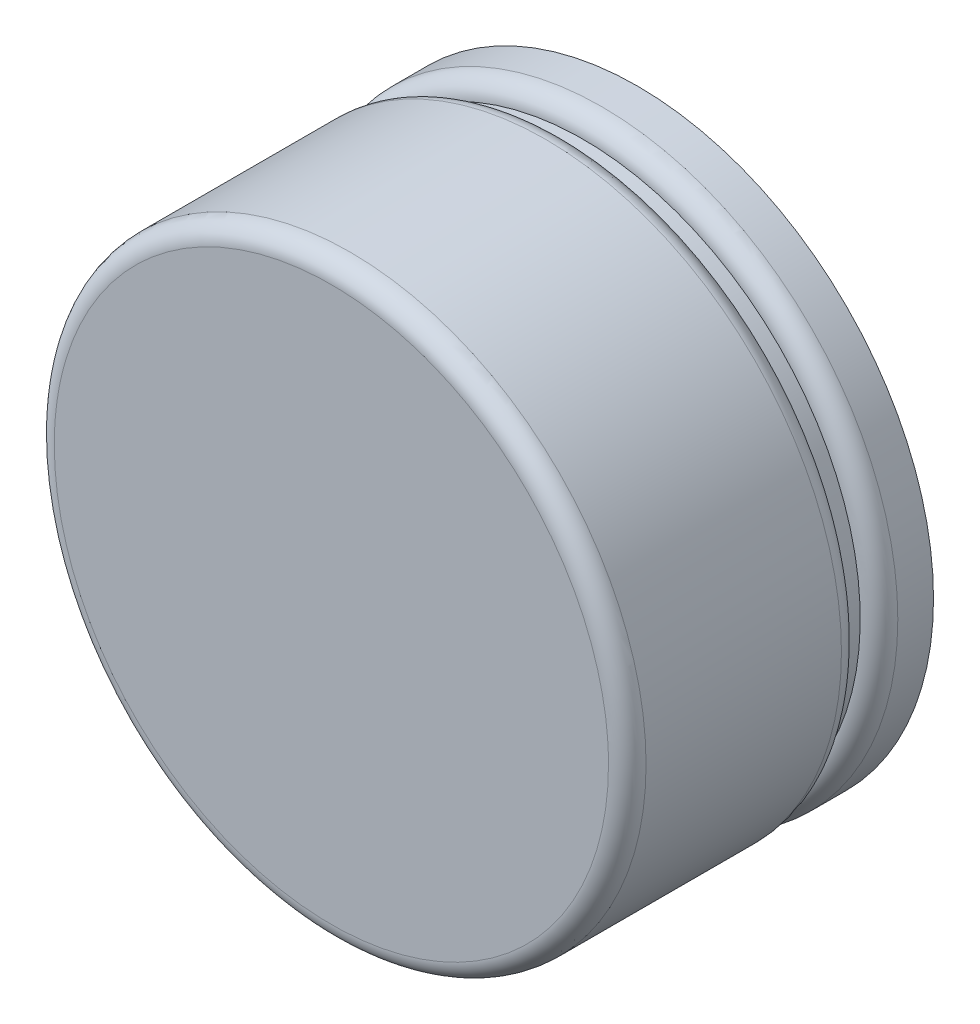
ISO-10303-21;
HEADER;
FILE_DESCRIPTION(('STEP AP214'),'2;1');
FILE_NAME('part.step','',(''),(''),'','','');
FILE_SCHEMA(('AUTOMOTIVE_DESIGN { 1 0 10303 214 1 1 1 1 }'));
ENDSEC;
DATA;
#1=APPLICATION_CONTEXT('core data for automotive mechanical design processes');
#2=APPLICATION_PROTOCOL_DEFINITION('international standard','automotive_design',2000,#1);
#3=PRODUCT_CONTEXT('',#1,'mechanical');
#4=PRODUCT('Part','Part','',(#3));
#5=PRODUCT_RELATED_PRODUCT_CATEGORY('part','',(#4));
#6=PRODUCT_DEFINITION_FORMATION('','',#4);
#7=PRODUCT_DEFINITION_CONTEXT('part definition',#1,'design');
#8=PRODUCT_DEFINITION('design','',#6,#7);
#9=PRODUCT_DEFINITION_SHAPE('','',#8);
#10=(LENGTH_UNIT() NAMED_UNIT(*) SI_UNIT(.MILLI.,.METRE.));
#11=(NAMED_UNIT(*) PLANE_ANGLE_UNIT() SI_UNIT($,.RADIAN.));
#12=(NAMED_UNIT(*) SI_UNIT($,.STERADIAN.) SOLID_ANGLE_UNIT());
#13=UNCERTAINTY_MEASURE_WITH_UNIT(LENGTH_MEASURE(1.E-05),#10,'distance_accuracy_value','');
#14=(GEOMETRIC_REPRESENTATION_CONTEXT(3) GLOBAL_UNCERTAINTY_ASSIGNED_CONTEXT((#13)) GLOBAL_UNIT_ASSIGNED_CONTEXT((#10,
#11,#12)) REPRESENTATION_CONTEXT('',''));
#15=CARTESIAN_POINT('',(0.,0.,0.));
#16=DIRECTION('',(0.,0.,1.));
#17=DIRECTION('',(1.,0.,0.));
#18=AXIS2_PLACEMENT_3D('',#15,#16,#17);
#19=CARTESIAN_POINT('',(-3.62999782,0.94000066,3.89999982));
#20=DIRECTION('',(0.,0.,-1.));
#21=DIRECTION('',(-1.,0.,0.));
#22=AXIS2_PLACEMENT_3D('',#19,#20,#21);
#23=PLANE('',#22);
#24=CARTESIAN_POINT('',(-2.94999746023,-2.814200619999,3.89999982));
#25=CARTESIAN_POINT('',(-2.94998656912479,-2.78333603266905,3.89999981996165));
#26=CARTESIAN_POINT('',(-2.94949204812357,-2.75247162762383,3.89999981908092));
#27=CARTESIAN_POINT('',(-2.947536979724,-2.69077372065067,3.89999981644401));
#28=CARTESIAN_POINT('',(-2.94607644150007,-2.65994021843204,3.89999981468783));
#29=CARTESIAN_POINT('',(-2.94219058593394,-2.59833429240035,3.8999998111093));
#30=CARTESIAN_POINT('',(-2.93976527561184,-2.5675618681445,3.89999980928694));
#31=CARTESIAN_POINT('',(-2.93395231715945,-2.50610820535019,3.89999980611445));
#32=CARTESIAN_POINT('',(-2.93056467389436,-2.47542696635152,3.89999980476432));
#33=CARTESIAN_POINT('',(-2.92283036025778,-2.41418569427481,3.89999980287637));
#34=CARTESIAN_POINT('',(-2.91848369260493,-2.38362566085343,3.89999980233856));
#35=CARTESIAN_POINT('',(-2.90883559218015,-2.32265670083603,3.8999998021977));
#36=CARTESIAN_POINT('',(-2.90353415999437,-2.29224777414725,3.89999980259465));
#37=CARTESIAN_POINT('',(-2.89198172141573,-2.23161078250524,3.89999980423281));
#38=CARTESIAN_POINT('',(-2.885730713497,-2.20138271784271,3.89999980547402));
#39=CARTESIAN_POINT('',(-2.87228522601163,-2.1411370242423,3.89999980849791));
#40=CARTESIAN_POINT('',(-2.86509074283375,-2.11111939611035,3.89999981028061));
#41=CARTESIAN_POINT('',(-2.8497653802966,-2.05132396199588,3.89999981386485));
#42=CARTESIAN_POINT('',(-2.8416344952738,-2.02154615746502,3.8999998156664));
#43=CARTESIAN_POINT('',(-2.8244441140914,-1.9622594588872,3.89999981857563));
#44=CARTESIAN_POINT('',(-2.81538461025343,-1.93275056706595,3.89999981968329));
#45=CARTESIAN_POINT('',(-2.79661839286601,-1.87486956003812,3.89999982018331));
#46=CARTESIAN_POINT('',(-2.78693755225507,-1.84648904765891,3.89999981962374));
#47=CARTESIAN_POINT('',(-2.76525849705961,-1.78596784713514,3.89999981582176));
#48=CARTESIAN_POINT('',(-2.75312737235231,-1.75387465839311,3.89999981220435));
#49=CARTESIAN_POINT('',(-2.72810450510623,-1.69101646594161,3.89999980263586));
#50=CARTESIAN_POINT('',(-2.71524322686163,-1.66023932373492,3.89999979675235));
#51=CARTESIAN_POINT('',(-2.68848373864091,-1.59913856583574,3.89999978295252));
#52=CARTESIAN_POINT('',(-2.67458551429574,-1.56881495643489,3.89999977503617));
#53=CARTESIAN_POINT('',(-2.645768026803,-1.50865637898672,3.89999975754429));
#54=CARTESIAN_POINT('',(-2.63084875017343,-1.47882141739797,3.89999974796874));
#55=CARTESIAN_POINT('',(-2.60000634323925,-1.41967447887022,3.89999972748893));
#56=CARTESIAN_POINT('',(-2.5840832003351,-1.3903625085012,3.89999971658466));
#57=CARTESIAN_POINT('',(-2.55125137384283,-1.33229534947617,3.89999969376588));
#58=CARTESIAN_POINT('',(-2.53434267852857,-1.30354016745026,3.89999968185136));
#59=CARTESIAN_POINT('',(-2.49955920572986,-1.24661972592519,3.89999965731024));
#60=CARTESIAN_POINT('',(-2.48168441738159,-1.21845447306479,3.89999964468363));
#61=CARTESIAN_POINT('',(-2.4449893295642,-1.16274635503537,3.89999961899838));
#62=CARTESIAN_POINT('',(-2.42616902007991,-1.13520349646338,3.89999960593973));
#63=CARTESIAN_POINT('',(-2.38760455328445,-1.08077191443184,3.89999957965175));
#64=CARTESIAN_POINT('',(-2.36786038679074,-1.05388319747809,3.89999956642242));
#65=CARTESIAN_POINT('',(-2.32747093335024,-1.00079089113249,3.89999954003586));
#66=CARTESIAN_POINT('',(-2.3068256380351,-0.974587308106785,3.89999952687862));
#67=CARTESIAN_POINT('',(-2.26465770146871,-0.922895478063116,3.89999950086062));
#68=CARTESIAN_POINT('',(-2.24313505264263,-0.897407237224439,3.89999948799987));
#69=CARTESIAN_POINT('',(-2.19923716934043,-0.847175454534894,3.89999946277988));
#70=CARTESIAN_POINT('',(-2.1768619280598,-0.822431918630308,3.89999945042065));
#71=CARTESIAN_POINT('',(-2.13128470383668,-0.773718128857052,3.89999942639314));
#72=CARTESIAN_POINT('',(-2.1080827148356,-0.74974788065765,3.89999941472487));
#73=CARTESIAN_POINT('',(-2.06087842097136,-0.702608065098153,3.89999939223902));
#74=CARTESIAN_POINT('',(-2.03687611076565,-0.679438503085126,3.89999938142145));
#75=CARTESIAN_POINT('',(-1.98809991339434,-0.633927628499993,3.8999993608197));
#76=CARTESIAN_POINT('',(-1.96332602158167,-0.61158632091804,3.89999935103552));
#77=CARTESIAN_POINT('',(-1.90225535049494,-0.558363460959972,3.89999932854052));
#78=CARTESIAN_POINT('',(-1.86556989362925,-0.527924649404212,3.89999931637218));
#79=CARTESIAN_POINT('',(-1.8138445581163,-0.487082532911913,3.89999930180976));
#80=CARTESIAN_POINT('',(-1.79941133270163,-0.475902240749047,3.89999929801648));
#81=CARTESIAN_POINT('',(-1.75943735918186,-0.445527578467647,3.89999928865533));
#82=CARTESIAN_POINT('',(-1.73368412362646,-0.426611120081036,3.89999928389005));
#83=CARTESIAN_POINT('',(-1.68157692287816,-0.389625989722038,3.89999927666515));
#84=CARTESIAN_POINT('',(-1.65522295769566,-0.371557317734983,3.89999927420553));
#85=CARTESIAN_POINT('',(-1.60194136449287,-0.336286224838534,3.89999927168656));
#86=CARTESIAN_POINT('',(-1.57501373707821,-0.319083803014697,3.89999927162721));
#87=CARTESIAN_POINT('',(-1.52061354107284,-0.285563589037472,3.89999927389755));
#88=CARTESIAN_POINT('',(-1.49314097362336,-0.269245795031738,3.89999927622724));
#89=CARTESIAN_POINT('',(-1.43767991641102,-0.237512054003843,3.89999928323319));
#90=CARTESIAN_POINT('',(-1.40969142826448,-0.222096104156933,3.89999928790943));
#91=CARTESIAN_POINT('',(-1.35322817048996,-0.192182372069379,3.89999929951475));
#92=CARTESIAN_POINT('',(-1.32475340289061,-0.177684585999588,3.89999930644382));
#93=CARTESIAN_POINT('',(-1.26734772222834,-0.149622512276025,3.89999932241518));
#94=CARTESIAN_POINT('',(-1.23841681154229,-0.136058219759981,3.89999933145745));
#95=CARTESIAN_POINT('',(-1.18012946941592,-0.109877478176953,3.89999935146826));
#96=CARTESIAN_POINT('',(-1.15077304063515,-0.0972610231888916,3.89999936243679));
#97=CARTESIAN_POINT('',(-1.09166573633371,-0.0729892952507877,3.89999938606623));
#98=CARTESIAN_POINT('',(-1.06191486368848,-0.0613340152983966,3.89999939872713));
#99=CARTESIAN_POINT('',(-1.00205016378745,-0.0389969568893163,3.89999942546038));
#100=CARTESIAN_POINT('',(-0.971936339555039,-0.0283151703297704,3.89999943953272));
#101=CARTESIAN_POINT('',(-0.911377612766426,-0.00793638554985654,3.89999946876091));
#102=CARTESIAN_POINT('',(-0.880932713312637,0.00176062188982259,3.89999948391674));
#103=CARTESIAN_POINT('',(-0.819744062778604,0.0201596059689792,3.89999951493695));
#104=CARTESIAN_POINT('',(-0.789000314810044,0.0288615929568403,3.89999953080131));
#105=CARTESIAN_POINT('',(-0.727246510083377,0.0452613492897754,3.89999956281658));
#106=CARTESIAN_POINT('',(-0.696236456375758,0.0529591301215521,3.89999957896748));
#107=CARTESIAN_POINT('',(-0.633982864530534,0.0673423513262271,3.8999996110868));
#108=CARTESIAN_POINT('',(-0.602739329311198,0.074027804330011,3.89999962705521));
#109=CARTESIAN_POINT('',(-0.540051845602893,0.0863793246001534,3.89999965829359));
#110=CARTESIAN_POINT('',(-0.508607899828545,0.0920454056439579,3.89999967356357));
#111=CARTESIAN_POINT('',(-0.445552877223734,0.102352203377607,3.89999970284167));
#112=CARTESIAN_POINT('',(-0.413941802832561,0.106992934990647,3.89999971684981));
#113=CARTESIAN_POINT('',(-0.350585983152924,0.115244196616649,3.89999974299545));
#114=CARTESIAN_POINT('',(-0.318841239956588,0.118854742693267,3.89999975513297));
#115=CARTESIAN_POINT('',(-0.255251676786514,0.1250416872316,3.89999977687543));
#116=CARTESIAN_POINT('',(-0.223406858486083,0.127618102892759,3.89999978648042));
#117=CARTESIAN_POINT('',(-0.159650868952376,0.131734688511451,3.89999980247167));
#118=CARTESIAN_POINT('',(-0.127739698901578,0.13327487677987,3.899999808858));
#119=CARTESIAN_POINT('',(-0.063884706199022,0.135315204786564,3.89999981759357));
#120=CARTESIAN_POINT('',(-0.0319408841693628,0.135815363983542,3.89999981994289));
#121=CARTESIAN_POINT('',(0.0308615335931829,0.135783939100536,3.89999982005517));
#122=CARTESIAN_POINT('',(0.0617201558809981,0.13528680469971,3.89999981797114));
#123=CARTESIAN_POINT('',(0.123405303322738,0.133337518084348,3.899999815993));
#124=CARTESIAN_POINT('',(0.154231830355136,0.131885425321787,3.89999981609876));
#125=CARTESIAN_POINT('',(0.215823521443506,0.128026038031054,3.89999981762233));
#126=CARTESIAN_POINT('',(0.246588688524088,0.125618791816389,3.89999981904007));
#127=CARTESIAN_POINT('',(0.308028144170308,0.11985064985322,3.89999982093833));
#128=CARTESIAN_POINT('',(0.338702436224635,0.116489791206079,3.89999982141889));
#129=CARTESIAN_POINT('',(0.399932212015395,0.108823027803236,3.899999797238));
#130=CARTESIAN_POINT('',(0.430487698963827,0.104517148780356,3.89999977257722));
#131=CARTESIAN_POINT('',(0.491446393661117,0.0949442963561456,3.89999972831255));
#132=CARTESIAN_POINT('',(0.521849603771004,0.0896773379039022,3.89999970870857));
#133=CARTESIAN_POINT('',(0.578160271022833,0.079078349903782,3.89999949105745));
#134=CARTESIAN_POINT('',(0.604089528283486,0.0738630964198867,3.89999931890124));
#135=CARTESIAN_POINT('',(0.641881264479752,0.0656029191828213,3.89999932585468));
#136=CARTESIAN_POINT('',(0.653818077612391,0.0628970262584427,3.89999936595094));
#137=CARTESIAN_POINT('',(0.700060379536812,0.0521198412120707,3.89999950016575));
#138=CARTESIAN_POINT('',(0.734243891237043,0.0435222340903233,3.89999955419181));
#139=CARTESIAN_POINT('',(0.824480377890324,0.0190828823815541,3.89999968983964));
#140=CARTESIAN_POINT('',(0.8802496745146,0.00217476350842326,3.89999976646632));
#141=CARTESIAN_POINT('',(0.961417163357132,-0.0250550284498059,3.89999981140579));
#142=CARTESIAN_POINT('',(0.987246276478302,-0.0341179605571215,3.89999981560067));
#143=CARTESIAN_POINT('',(1.03892274735408,-0.0530383841052417,3.899999819546));
#144=CARTESIAN_POINT('',(1.06476741537919,-0.0629032578488211,3.89999981924902));
#145=CARTESIAN_POINT('',(1.11644445636963,-0.083447631207986,3.89999981814462));
#146=CARTESIAN_POINT('',(1.14227386584472,-0.0941345803671877,3.89999981733188));
#147=CARTESIAN_POINT('',(1.19389394296324,-0.116332277080779,3.89999979765102));
#148=CARTESIAN_POINT('',(1.21968142305875,-0.127850426750571,3.89999977859549));
#149=CARTESIAN_POINT('',(1.2863315970573,-0.158770756248805,3.89999968809032));
#150=CARTESIAN_POINT('',(1.32692990554454,-0.17874707945681,3.89999959201596));
#151=CARTESIAN_POINT('',(1.40461813685161,-0.219244362611429,3.89999939852606));
#152=CARTESIAN_POINT('',(1.44176766630444,-0.239651179481089,3.89999930157874));
#153=CARTESIAN_POINT('',(1.50852739918989,-0.278235883032866,3.89999914992207));
#154=CARTESIAN_POINT('',(1.53828911151493,-0.296152109126007,3.89999909074859));
#155=CARTESIAN_POINT('',(1.59529776705711,-0.331874390679513,3.89999901418626));
#156=CARTESIAN_POINT('',(1.62258496674059,-0.349616190955958,3.89999899439846));
#157=CARTESIAN_POINT('',(1.67473186354908,-0.384781569217341,3.89999900252217));
#158=CARTESIAN_POINT('',(1.69963134130339,-0.402146208044008,3.89999902731318));
#159=CARTESIAN_POINT('',(1.7470966118819,-0.436367607737054,3.89999911547853));
#160=CARTESIAN_POINT('',(1.76970113776078,-0.453170578541229,3.89999917593918));
#161=CARTESIAN_POINT('',(1.80404385109819,-0.479493703003184,3.89999929972685));
#162=CARTESIAN_POINT('',(1.81596252485446,-0.488779720704501,3.8999993487371));
#163=CARTESIAN_POINT('',(1.86357088906276,-0.526460889395669,3.89999952571191));
#164=CARTESIAN_POINT('',(1.89868260348473,-0.555594153632464,3.89999961336592));
#165=CARTESIAN_POINT('',(1.9577811762354,-0.606946687384394,3.89999970166296));
#166=CARTESIAN_POINT('',(1.98210087300311,-0.628785606474449,3.89999971992462));
#167=CARTESIAN_POINT('',(2.0304682404309,-0.673674105095924,3.89999974311937));
#168=CARTESIAN_POINT('',(2.05450188313859,-0.696738828675039,3.89999974779169));
#169=CARTESIAN_POINT('',(2.10222778988162,-0.744097851743785,3.89999974453842));
#170=CARTESIAN_POINT('',(2.12590523470977,-0.768407087982958,3.8999997363753));
#171=CARTESIAN_POINT('',(2.17284469895367,-0.818272310671739,3.89999970344145));
#172=CARTESIAN_POINT('',(2.19609106293151,-0.843843005923879,3.89999967836796));
#173=CARTESIAN_POINT('',(2.25217027133524,-0.907720013568825,3.8999995699267));
#174=CARTESIAN_POINT('',(2.28449562640821,-0.946475468693618,3.89999946505406));
#175=CARTESIAN_POINT('',(2.32752569512042,-1.00082713475863,3.89999924625473));
#176=CARTESIAN_POINT('',(2.33910265997358,-1.01574077793716,3.89999917905376));
#177=CARTESIAN_POINT('',(2.37053797554478,-1.05705981153435,3.89999899952786));
#178=CARTESIAN_POINT('',(2.39009563213045,-1.0836954583785,3.89999889115858));
#179=CARTESIAN_POINT('',(2.42829605649922,-1.13761400443765,3.89999869588656));
#180=CARTESIAN_POINT('',(2.44693881839956,-1.16489690781285,3.89999860898397));
#181=CARTESIAN_POINT('',(2.48328764738404,-1.22007982763328,3.89999847204115));
#182=CARTESIAN_POINT('',(2.50099371933169,-1.24797984087328,3.89999842200075));
#183=CARTESIAN_POINT('',(2.53544863192492,-1.30436406910362,3.89999836504905));
#184=CARTESIAN_POINT('',(2.55219748866016,-1.33284827426345,3.89999835813703));
#185=CARTESIAN_POINT('',(2.58471854091882,-1.3903678220864,3.89999838853563));
#186=CARTESIAN_POINT('',(2.60049076419945,-1.41940314905524,3.899998425845));
#187=CARTESIAN_POINT('',(2.63104024551933,-1.47799111808806,3.89999853958546));
#188=CARTESIAN_POINT('',(2.64581754338659,-1.5075437393844,3.89999861601497));
#189=CARTESIAN_POINT('',(2.67436022127937,-1.56713175922734,3.89999879682833));
#190=CARTESIAN_POINT('',(2.68812565355729,-1.59716713274703,3.89999890121073));
#191=CARTESIAN_POINT('',(2.71462820893528,-1.65768608366292,3.89999912120377));
#192=CARTESIAN_POINT('',(2.72736539706993,-1.68816963256847,3.89999923681369));
#193=CARTESIAN_POINT('',(2.75005371631711,-1.74516431090726,3.89999943924748));
#194=CARTESIAN_POINT('',(2.76014287174225,-1.77162058681697,3.89999952782404));
#195=CARTESIAN_POINT('',(2.77954160289353,-1.82481510016265,3.89999968086076));
#196=CARTESIAN_POINT('',(2.78885123528786,-1.85155331694326,3.89999974532267));
#197=CARTESIAN_POINT('',(2.8088738929867,-1.911799278362,3.89999982316435));
#198=CARTESIAN_POINT('',(2.81937966251381,-1.9453760321754,3.89999982036293));
#199=CARTESIAN_POINT('',(2.83922747375086,-2.01286423295857,3.89999981410316));
#200=CARTESIAN_POINT('',(2.84856974097247,-2.04677561369103,3.89999981064494));
#201=CARTESIAN_POINT('',(2.86498603829643,-2.11063816781467,3.89999980837064));
#202=CARTESIAN_POINT('',(2.8721976173291,-2.14055398717919,3.89999980902791));
#203=CARTESIAN_POINT('',(2.88569386897522,-2.20058995743871,3.89999983023034));
#204=CARTESIAN_POINT('',(2.89197863081933,-2.2307100883709,3.89999985077359));
#205=CARTESIAN_POINT('',(2.90286890769543,-2.28679967530244,3.8999996306984));
#206=CARTESIAN_POINT('',(2.90758604978142,-2.31274720106866,3.89999942698026));
#207=CARTESIAN_POINT('',(2.91467907681749,-2.35592904403284,3.89999936315485));
#208=CARTESIAN_POINT('',(2.91730532776551,-2.373122613099,3.89999940968476));
#209=CARTESIAN_POINT('',(2.9285783256695,-2.4515183195885,3.89999960086548));
#210=CARTESIAN_POINT('',(2.93547424141184,-2.51298768074767,3.89999969267502));
#211=CARTESIAN_POINT('',(2.94219009689721,-2.59658947207228,3.89999977094471));
#212=CARTESIAN_POINT('',(2.94370867764874,-2.61859884102348,3.89999978718523));
#213=CARTESIAN_POINT('',(2.94832402452199,-2.6984086892099,3.89999983158483));
#214=CARTESIAN_POINT('',(2.94997915047775,-2.75629179449363,3.89999983627282));
#215=CARTESIAN_POINT('',(2.95000254023,-2.81420062,3.89999982));
#216=B_SPLINE_CURVE_WITH_KNOTS('',3,(#24,#25,#26,#27,#28,#29,#30,#31,#32,#33,#34,#35,#36,#37,
#38,#39,#40,#41,#42,#43,#44,#45,#46,#47,#48,#49,#50,#51,#52,#53,#54,#55,#56,#57,#58,#59,#60,#61,
#62,#63,#64,#65,#66,#67,#68,#69,#70,#71,#72,#73,#74,#75,#76,#77,#78,#79,#80,#81,#82,#83,#84,#85,
#86,#87,#88,#89,#90,#91,#92,#93,#94,#95,#96,#97,#98,#99,#100,#101,#102,#103,#104,#105,#106,#107,
#108,#109,#110,#111,#112,#113,#114,#115,#116,#117,#118,#119,#120,#121,#122,#123,#124,#125,#126,
#127,#128,#129,#130,#131,#132,#133,#134,#135,#136,#137,#138,#139,#140,#141,#142,#143,#144,#145,
#146,#147,#148,#149,#150,#151,#152,#153,#154,#155,#156,#157,#158,#159,#160,#161,#162,#163,#164,
#165,#166,#167,#168,#169,#170,#171,#172,#173,#174,#175,#176,#177,#178,#179,#180,#181,#182,#183,
#184,#185,#186,#187,#188,#189,#190,#191,#192,#193,#194,#195,#196,#197,#198,#199,#200,#201,#202,
#203,#204,#205,#206,#207,#208,#209,#210,#211,#212,#213,#214,#215),.UNSPECIFIED.,.F.,.F.,(4,2,2,
2,2,2,2,2,2,2,2,2,2,2,2,2,2,2,2,2,2,2,2,2,2,2,2,2,2,2,2,2,2,2,2,2,2,2,2,2,2,2,2,2,2,2,2,2,2,2,2,
2,2,2,2,2,2,2,2,2,2,2,2,2,2,2,2,2,2,2,2,2,2,2,2,2,2,2,2,2,2,2,2,2,2,2,2,2,2,2,2,2,2,2,2,4),(0.,
0.092589968822205,0.185179058315603,0.277767474102313,0.370355421804196,0.462943107042843,
0.555530735439567,0.648118512615411,0.74070664419115,0.833295335787277,0.925884793024017,
1.01582997239142,1.11873675651714,1.21878677046284,1.31883817106825,1.41889089301018,
1.51894487096523,1.61900003960975,1.7190563336199,1.81911368767163,1.9191720364407,
2.01923131460269,2.11929145683296,2.21935239780673,2.319414072199,2.41947641468461,
2.51953935993819,2.66248020141717,2.71724938972386,2.81309269106016,2.90893599073827,
3.00477918923889,3.10062218704316,3.19646488463271,3.29230718248965,3.38814898109652,
3.48399018093632,3.5798306824925,3.67567038624892,3.77150919268988,3.86734700230012,
3.96318371556479,4.05901923296949,4.15485345500025,4.25068628214357,4.34651761488639,
4.44234735371616,4.53817539912083,4.6340016515889,4.72657474879918,4.81914208331589,
4.91170473619489,5.00426378831366,5.09682032037013,5.18937541288093,5.26870886547306,
5.30542683513086,5.41115111909014,5.58585891451677,5.66797055113522,5.7509496128967,
5.83479771205147,5.91951650928956,6.05520512595816,6.18232123690002,6.2865145949125,
6.38413957876962,6.47519450686959,6.5596780127126,6.60500441518204,6.74182033112771,
6.83986372690886,6.93977649919346,7.04156014462291,7.14521624322954,7.29653955896459,
7.35317672791273,7.45228984569986,7.55140360069965,7.65051684102835,7.74962841489012,
7.84873717057609,7.94784195646305,8.04694162101232,8.14603501276936,8.2309674215756,
8.31589365076539,8.42141760114094,8.52692106677864,8.61922459119139,8.71151922313922,
8.79062502965599,8.84280208440775,9.02821367361524,9.09439505127968,9.26804600370642),.UNSPECIFIED.);
#217=CARTESIAN_POINT('',(-2.94999746023,-2.81420061999916,3.89999982));
#218=VERTEX_POINT('',#217);
#219=CARTESIAN_POINT('',(2.95000254023,-2.8142006200004,3.89999982));
#220=VERTEX_POINT('',#219);
#221=EDGE_CURVE('E34',#218,#220,#216,.T.);
#222=ORIENTED_EDGE('',*,*,#221,.F.);
#223=CARTESIAN_POINT('',(2.54000000055E-06,-2.81420062,3.89999982));
#224=DIRECTION('',(0.,0.,-1.));
#225=DIRECTION('',(1.,0.,0.));
#226=AXIS2_PLACEMENT_3D('',#223,#224,#225);
#227=CIRCLE('',#226,2.95000000023);
#228=EDGE_CURVE('E37',#220,#218,#227,.T.);
#229=ORIENTED_EDGE('',*,*,#228,.F.);
#230=EDGE_LOOP('',(#222,#229));
#231=FACE_BOUND('',#230,.T.);
#232=ADVANCED_FACE('F16',(#231),#23,.F.);
#233=CARTESIAN_POINT('',(2.54000000055E-06,-2.81420062,3.69999982));
#234=DIRECTION('',(0.,0.,1.));
#235=DIRECTION('',(1.,0.,0.));
#236=AXIS2_PLACEMENT_3D('',#233,#234,#235);
#237=TOROIDAL_SURFACE('',#236,2.95000000023,0.2);
#238=CARTESIAN_POINT('',(2.54000000055E-06,-2.81420062,3.69999982));
#239=DIRECTION('',(0.,0.,-1.));
#240=DIRECTION('',(-1.,0.,0.));
#241=AXIS2_PLACEMENT_3D('',#238,#239,#240);
#242=CIRCLE('',#241,3.15000000023);
#243=CARTESIAN_POINT('',(-3.14999746023,-2.81420062,3.69999982));
#244=VERTEX_POINT('',#243);
#245=EDGE_CURVE('E41',#244,#244,#242,.T.);
#246=ORIENTED_EDGE('',*,*,#245,.F.);
#247=EDGE_LOOP('',(#246));
#248=FACE_BOUND('',#247,.T.);
#249=ORIENTED_EDGE('',*,*,#228,.T.);
#250=ORIENTED_EDGE('',*,*,#221,.T.);
#251=EDGE_LOOP('',(#249,#250));
#252=FACE_BOUND('',#251,.T.);
#253=ADVANCED_FACE('F44',(#248,#252),#237,.T.);
#254=CARTESIAN_POINT('',(2.54000000055E-06,-2.81420062,5.21999996));
#255=DIRECTION('',(0.,0.,-1.));
#256=DIRECTION('',(-1.,0.,0.));
#257=AXIS2_PLACEMENT_3D('',#254,#255,#256);
#258=CYLINDRICAL_SURFACE('',#257,3.15000000023);
#259=ORIENTED_EDGE('',*,*,#245,.T.);
#260=EDGE_LOOP('',(#259));
#261=FACE_BOUND('',#260,.T.);
#262=CARTESIAN_POINT('',(2.54000000004216E-06,-2.81420062,1.61999996));
#263=DIRECTION('',(0.,0.,1.));
#264=DIRECTION('',(0.,-1.,0.));
#265=AXIS2_PLACEMENT_3D('',#262,#263,#264);
#266=CIRCLE('',#265,3.15000000042924);
#267=CARTESIAN_POINT('',(2.54000000004216E-06,-5.96420062042924,1.61999996));
#268=VERTEX_POINT('',#267);
#269=EDGE_CURVE('E74',#268,#268,#266,.T.);
#270=ORIENTED_EDGE('',*,*,#269,.T.);
#271=EDGE_LOOP('',(#270));
#272=FACE_BOUND('',#271,.T.);
#273=ADVANCED_FACE('F58',(#261,#272),#258,.T.);
#274=CARTESIAN_POINT('',(2.540000000259E-06,-2.81420062,1.61999996));
#275=DIRECTION('',(0.,0.,-1.));
#276=DIRECTION('',(0.,1.,0.));
#277=AXIS2_PLACEMENT_3D('',#274,#275,#276);
#278=TOROIDAL_SURFACE('',#277,2.95000000042795,0.200000000001143);
#279=CARTESIAN_POINT('',(2.54000000055E-06,-2.81420062,1.41999996));
#280=DIRECTION('',(0.,0.,-1.));
#281=DIRECTION('',(-1.,0.,0.));
#282=AXIS2_PLACEMENT_3D('',#279,#280,#281);
#283=CIRCLE('',#282,2.950000000428);
#284=CARTESIAN_POINT('',(-2.949997460428,-2.81420062,1.41999996));
#285=VERTEX_POINT('',#284);
#286=EDGE_CURVE('E77',#285,#285,#283,.T.);
#287=ORIENTED_EDGE('',*,*,#286,.F.);
#288=EDGE_LOOP('',(#287));
#289=FACE_BOUND('',#288,.T.);
#290=ORIENTED_EDGE('',*,*,#269,.F.);
#291=EDGE_LOOP('',(#290));
#292=FACE_BOUND('',#291,.T.);
#293=ADVANCED_FACE('F96',(#289,#292),#278,.T.);
#294=CARTESIAN_POINT('',(2.54000000055E-06,-2.81420062,1.41999996));
#295=DIRECTION('',(0.,0.,-1.));
#296=DIRECTION('',(-1.,0.,0.));
#297=AXIS2_PLACEMENT_3D('',#294,#295,#296);
#298=CYLINDRICAL_SURFACE('',#297,2.950000000428);
#299=CARTESIAN_POINT('',(2.54000000004216E-06,-2.81420062,1.21999996));
#300=DIRECTION('',(0.,0.,1.));
#301=DIRECTION('',(0.,-1.,0.));
#302=AXIS2_PLACEMENT_3D('',#299,#300,#301);
#303=CIRCLE('',#302,2.95000000042795);
#304=CARTESIAN_POINT('',(2.54000000004216E-06,-5.76420062042795,1.21999996));
#305=VERTEX_POINT('',#304);
#306=EDGE_CURVE('E80',#305,#305,#303,.T.);
#307=ORIENTED_EDGE('',*,*,#306,.T.);
#308=EDGE_LOOP('',(#307));
#309=FACE_BOUND('',#308,.T.);
#310=ORIENTED_EDGE('',*,*,#286,.T.);
#311=EDGE_LOOP('',(#310));
#312=FACE_BOUND('',#311,.T.);
#313=ADVANCED_FACE('F91',(#309,#312),#298,.T.);
#314=CARTESIAN_POINT('',(2.540000000259E-06,-2.81420062,1.01999996));
#315=DIRECTION('',(0.,0.,-1.));
#316=DIRECTION('',(0.,1.,0.));
#317=AXIS2_PLACEMENT_3D('',#314,#315,#316);
#318=TOROIDAL_SURFACE('',#317,2.95000000042795,0.199999999999965);
#319=CARTESIAN_POINT('',(2.54000000055E-06,-2.81420062,1.01999996));
#320=DIRECTION('',(0.,0.,-1.));
#321=DIRECTION('',(-1.,0.,0.));
#322=AXIS2_PLACEMENT_3D('',#319,#320,#321);
#323=CIRCLE('',#322,3.15000000023);
#324=CARTESIAN_POINT('',(-3.14999746023,-2.81420062,1.01999996));
#325=VERTEX_POINT('',#324);
#326=EDGE_CURVE('E27',#325,#325,#323,.T.);
#327=ORIENTED_EDGE('',*,*,#326,.F.);
#328=EDGE_LOOP('',(#327));
#329=FACE_BOUND('',#328,.T.);
#330=ORIENTED_EDGE('',*,*,#306,.F.);
#331=EDGE_LOOP('',(#330));
#332=FACE_BOUND('',#331,.T.);
#333=ADVANCED_FACE('F18',(#329,#332),#318,.T.);
#334=CARTESIAN_POINT('',(2.54000000055E-06,-2.81420062,1.01999996));
#335=DIRECTION('',(0.,0.,-1.));
#336=DIRECTION('',(-1.,0.,0.));
#337=AXIS2_PLACEMENT_3D('',#334,#335,#336);
#338=CYLINDRICAL_SURFACE('',#337,3.15000000023);
#339=ORIENTED_EDGE('',*,*,#326,.T.);
#340=EDGE_LOOP('',(#339));
#341=FACE_BOUND('',#340,.T.);
#342=CARTESIAN_POINT('',(2.54000000055E-06,-2.81420062,0.64000126));
#343=DIRECTION('',(0.,0.,-1.));
#344=DIRECTION('',(-1.,0.,0.));
#345=AXIS2_PLACEMENT_3D('',#342,#343,#344);
#346=CIRCLE('',#345,3.15000000023);
#347=CARTESIAN_POINT('',(-3.14999746023,-2.81420062,0.64000126));
#348=VERTEX_POINT('',#347);
#349=EDGE_CURVE('E11',#348,#348,#346,.T.);
#350=ORIENTED_EDGE('',*,*,#349,.F.);
#351=EDGE_LOOP('',(#350));
#352=FACE_BOUND('',#351,.T.);
#353=ADVANCED_FACE('F86',(#341,#352),#338,.T.);
#354=CARTESIAN_POINT('',(-4.11999684,1.30999992,0.64000126));
#355=DIRECTION('',(0.,0.,-1.));
#356=DIRECTION('',(-1.,0.,0.));
#357=AXIS2_PLACEMENT_3D('',#354,#355,#356);
#358=PLANE('',#357);
#359=ORIENTED_EDGE('',*,*,#349,.T.);
#360=EDGE_LOOP('',(#359));
#361=FACE_BOUND('',#360,.T.);
#362=ADVANCED_FACE('F108',(#361),#358,.T.);
#363=CLOSED_SHELL('',(#232,#253,#273,#293,#313,#333,#353,#362));
#364=MANIFOLD_SOLID_BREP('B1',#363);
#365=ADVANCED_BREP_SHAPE_REPRESENTATION('',(#18,#364),#14);
#366=SHAPE_DEFINITION_REPRESENTATION(#9,#365);
ENDSEC;
END-ISO-10303-21;
